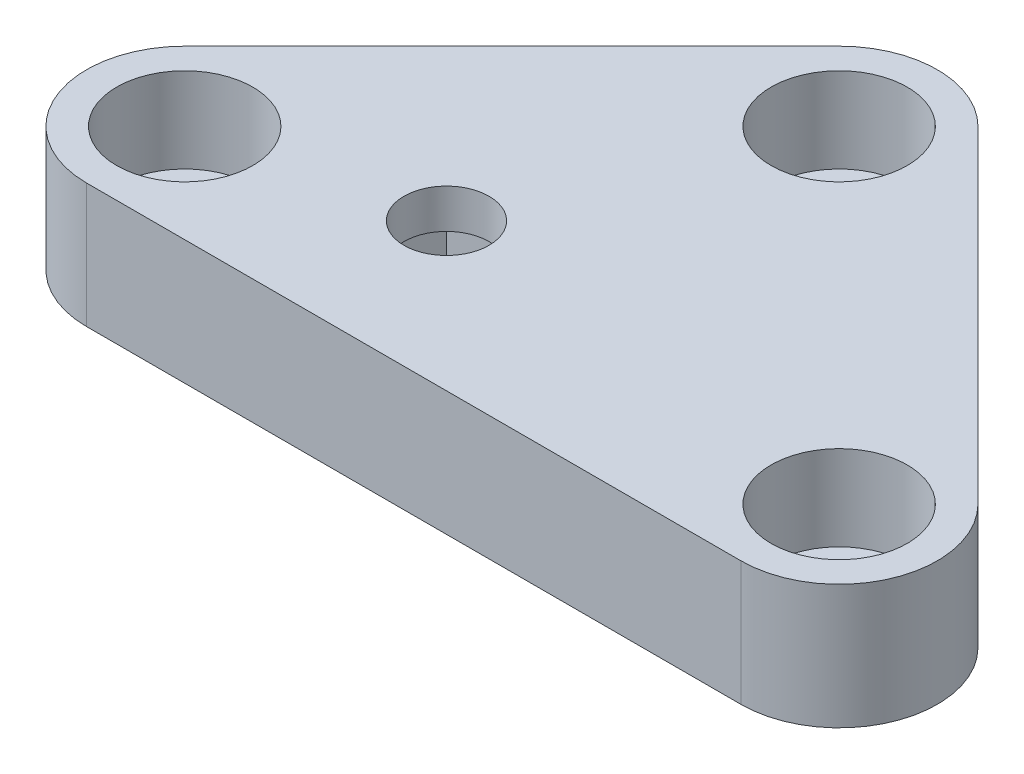
ISO-10303-21;
HEADER;
FILE_DESCRIPTION(('STEP AP214'),'2;1');
FILE_NAME('part.step','',(''),(''),'','','');
FILE_SCHEMA(('AUTOMOTIVE_DESIGN { 1 0 10303 214 1 1 1 1 }'));
ENDSEC;
DATA;
#1=APPLICATION_CONTEXT('core data for automotive mechanical design processes');
#2=APPLICATION_PROTOCOL_DEFINITION('international standard','automotive_design',2000,#1);
#3=PRODUCT_CONTEXT('',#1,'mechanical');
#4=PRODUCT('Part','Part','',(#3));
#5=PRODUCT_RELATED_PRODUCT_CATEGORY('part','',(#4));
#6=PRODUCT_DEFINITION_FORMATION('','',#4);
#7=PRODUCT_DEFINITION_CONTEXT('part definition',#1,'design');
#8=PRODUCT_DEFINITION('design','',#6,#7);
#9=PRODUCT_DEFINITION_SHAPE('','',#8);
#10=(LENGTH_UNIT() NAMED_UNIT(*) SI_UNIT(.MILLI.,.METRE.));
#11=(NAMED_UNIT(*) PLANE_ANGLE_UNIT() SI_UNIT($,.RADIAN.));
#12=(NAMED_UNIT(*) SI_UNIT($,.STERADIAN.) SOLID_ANGLE_UNIT());
#13=UNCERTAINTY_MEASURE_WITH_UNIT(LENGTH_MEASURE(1.E-05),#10,'distance_accuracy_value','');
#14=(GEOMETRIC_REPRESENTATION_CONTEXT(3) GLOBAL_UNCERTAINTY_ASSIGNED_CONTEXT((#13)) GLOBAL_UNIT_ASSIGNED_CONTEXT((#10,
#11,#12)) REPRESENTATION_CONTEXT('',''));
#15=CARTESIAN_POINT('',(0.,0.,0.));
#16=DIRECTION('',(0.,0.,1.));
#17=DIRECTION('',(1.,0.,0.));
#18=AXIS2_PLACEMENT_3D('',#15,#16,#17);
#19=CARTESIAN_POINT('',(0.,9.5,80.));
#20=DIRECTION('',(0.,-1.,0.));
#21=DIRECTION('',(0.,0.,-1.));
#22=AXIS2_PLACEMENT_3D('',#19,#20,#21);
#23=CYLINDRICAL_SURFACE('',#22,3.25);
#24=CARTESIAN_POINT('',(0.,9.5,80.));
#25=DIRECTION('',(0.,1.,0.));
#26=DIRECTION('',(0.,0.,1.));
#27=AXIS2_PLACEMENT_3D('',#24,#25,#26);
#28=CIRCLE('',#27,3.25);
#29=CARTESIAN_POINT('',(0.,9.5,83.25));
#30=VERTEX_POINT('',#29);
#31=EDGE_CURVE('E138',#30,#30,#28,.T.);
#32=ORIENTED_EDGE('',*,*,#31,.T.);
#33=EDGE_LOOP('',(#32));
#34=FACE_BOUND('',#33,.T.);
#35=CARTESIAN_POINT('',(0.,6.5,80.));
#36=DIRECTION('',(0.,-1.,0.));
#37=DIRECTION('',(0.,0.,-1.));
#38=AXIS2_PLACEMENT_3D('',#35,#36,#37);
#39=CIRCLE('',#38,3.25);
#40=CARTESIAN_POINT('',(0.,6.5,76.75));
#41=VERTEX_POINT('',#40);
#42=EDGE_CURVE('E445',#41,#41,#39,.T.);
#43=ORIENTED_EDGE('',*,*,#42,.T.);
#44=EDGE_LOOP('',(#43));
#45=FACE_BOUND('',#44,.T.);
#46=ADVANCED_FACE('F35',(#34,#45),#23,.F.);
#47=CARTESIAN_POINT('',(-16.25,9.5,83.75));
#48=DIRECTION('',(0.,-1.,0.));
#49=DIRECTION('',(0.,0.,-1.));
#50=AXIS2_PLACEMENT_3D('',#47,#48,#49);
#51=CYLINDRICAL_SURFACE('',#50,3.19999999999999);
#52=CARTESIAN_POINT('',(-16.25,0.,83.75));
#53=DIRECTION('',(0.,1.,0.));
#54=DIRECTION('',(0.,0.,1.));
#55=AXIS2_PLACEMENT_3D('',#52,#53,#54);
#56=CIRCLE('',#55,3.19999999999999);
#57=CARTESIAN_POINT('',(-16.25,0.,86.95));
#58=VERTEX_POINT('',#57);
#59=EDGE_CURVE('E187',#58,#58,#56,.T.);
#60=ORIENTED_EDGE('',*,*,#59,.F.);
#61=EDGE_LOOP('',(#60));
#62=FACE_BOUND('',#61,.T.);
#63=CARTESIAN_POINT('',(-16.25,3.,83.75));
#64=DIRECTION('',(0.,1.,0.));
#65=DIRECTION('',(0.,0.,1.));
#66=AXIS2_PLACEMENT_3D('',#63,#64,#65);
#67=CIRCLE('',#66,3.19999999999999);
#68=CARTESIAN_POINT('',(-16.25,3.,86.95));
#69=VERTEX_POINT('',#68);
#70=EDGE_CURVE('E39',#69,#69,#67,.T.);
#71=ORIENTED_EDGE('',*,*,#70,.T.);
#72=EDGE_LOOP('',(#71));
#73=FACE_BOUND('',#72,.T.);
#74=ADVANCED_FACE('F216',(#62,#73),#51,.F.);
#75=CARTESIAN_POINT('',(33.75,9.5,83.75));
#76=DIRECTION('',(0.,-1.,0.));
#77=DIRECTION('',(0.,0.,-1.));
#78=AXIS2_PLACEMENT_3D('',#75,#76,#77);
#79=CYLINDRICAL_SURFACE('',#78,3.2);
#80=CARTESIAN_POINT('',(33.75,0.,83.75));
#81=DIRECTION('',(0.,1.,0.));
#82=DIRECTION('',(0.,0.,1.));
#83=AXIS2_PLACEMENT_3D('',#80,#81,#82);
#84=CIRCLE('',#83,3.2);
#85=CARTESIAN_POINT('',(33.75,0.,86.95));
#86=VERTEX_POINT('',#85);
#87=EDGE_CURVE('E154',#86,#86,#84,.T.);
#88=ORIENTED_EDGE('',*,*,#87,.F.);
#89=EDGE_LOOP('',(#88));
#90=FACE_BOUND('',#89,.T.);
#91=CARTESIAN_POINT('',(33.75,3.,83.75));
#92=DIRECTION('',(0.,1.,0.));
#93=DIRECTION('',(0.,0.,1.));
#94=AXIS2_PLACEMENT_3D('',#91,#92,#93);
#95=CIRCLE('',#94,3.2);
#96=CARTESIAN_POINT('',(33.75,3.,86.95));
#97=VERTEX_POINT('',#96);
#98=EDGE_CURVE('E156',#97,#97,#95,.T.);
#99=ORIENTED_EDGE('',*,*,#98,.T.);
#100=EDGE_LOOP('',(#99));
#101=FACE_BOUND('',#100,.T.);
#102=ADVANCED_FACE('F222',(#90,#101),#79,.F.);
#103=CARTESIAN_POINT('',(8.75,9.5,58.75));
#104=DIRECTION('',(0.,-1.,0.));
#105=DIRECTION('',(0.,0.,-1.));
#106=AXIS2_PLACEMENT_3D('',#103,#104,#105);
#107=CYLINDRICAL_SURFACE('',#106,3.2);
#108=CARTESIAN_POINT('',(8.75,0.,58.75));
#109=DIRECTION('',(0.,1.,0.));
#110=DIRECTION('',(0.,0.,1.));
#111=AXIS2_PLACEMENT_3D('',#108,#109,#110);
#112=CIRCLE('',#111,3.2);
#113=CARTESIAN_POINT('',(8.75,0.,61.95));
#114=VERTEX_POINT('',#113);
#115=EDGE_CURVE('E190',#114,#114,#112,.T.);
#116=ORIENTED_EDGE('',*,*,#115,.F.);
#117=EDGE_LOOP('',(#116));
#118=FACE_BOUND('',#117,.T.);
#119=CARTESIAN_POINT('',(8.75,3.,58.75));
#120=DIRECTION('',(0.,1.,0.));
#121=DIRECTION('',(0.,0.,1.));
#122=AXIS2_PLACEMENT_3D('',#119,#120,#121);
#123=CIRCLE('',#122,3.2);
#124=CARTESIAN_POINT('',(8.75,3.,61.95));
#125=VERTEX_POINT('',#124);
#126=EDGE_CURVE('E152',#125,#125,#123,.T.);
#127=ORIENTED_EDGE('',*,*,#126,.T.);
#128=EDGE_LOOP('',(#127));
#129=FACE_BOUND('',#128,.T.);
#130=ADVANCED_FACE('F228',(#118,#129),#107,.F.);
#131=CARTESIAN_POINT('',(-16.25,9.5,83.75));
#132=DIRECTION('',(0.,1.,0.));
#133=DIRECTION('',(0.,0.,1.));
#134=AXIS2_PLACEMENT_3D('',#131,#132,#133);
#135=PLANE('',#134);
#136=CARTESIAN_POINT('',(33.75,9.5,83.75));
#137=DIRECTION('',(0.,1.,0.));
#138=DIRECTION('',(0.,0.,1.));
#139=AXIS2_PLACEMENT_3D('',#136,#137,#138);
#140=CIRCLE('',#139,5.2);
#141=CARTESIAN_POINT('',(33.75,9.5,88.95));
#142=VERTEX_POINT('',#141);
#143=EDGE_CURVE('E164',#142,#142,#140,.T.);
#144=ORIENTED_EDGE('',*,*,#143,.F.);
#145=EDGE_LOOP('',(#144));
#146=FACE_BOUND('',#145,.T.);
#147=CARTESIAN_POINT('',(-16.25,9.5,83.75));
#148=DIRECTION('',(0.,1.,0.));
#149=DIRECTION('',(0.,0.,1.));
#150=AXIS2_PLACEMENT_3D('',#147,#148,#149);
#151=CIRCLE('',#150,5.2);
#152=CARTESIAN_POINT('',(-16.25,9.5,88.95));
#153=VERTEX_POINT('',#152);
#154=EDGE_CURVE('E177',#153,#153,#151,.T.);
#155=ORIENTED_EDGE('',*,*,#154,.F.);
#156=EDGE_LOOP('',(#155));
#157=FACE_BOUND('',#156,.T.);
#158=CARTESIAN_POINT('',(8.75,9.5,58.75));
#159=DIRECTION('',(0.,1.,0.));
#160=DIRECTION('',(0.,0.,1.));
#161=AXIS2_PLACEMENT_3D('',#158,#159,#160);
#162=CIRCLE('',#161,5.2);
#163=CARTESIAN_POINT('',(8.75,9.5,63.95));
#164=VERTEX_POINT('',#163);
#165=EDGE_CURVE('E162',#164,#164,#162,.T.);
#166=ORIENTED_EDGE('',*,*,#165,.F.);
#167=EDGE_LOOP('',(#166));
#168=FACE_BOUND('',#167,.T.);
#169=ORIENTED_EDGE('',*,*,#31,.F.);
#170=EDGE_LOOP('',(#169));
#171=FACE_BOUND('',#170,.T.);
#172=CARTESIAN_POINT('',(-16.25,9.5,83.75));
#173=DIRECTION('',(0.,1.,0.));
#174=DIRECTION('',(0.,0.,1.));
#175=AXIS2_PLACEMENT_3D('',#172,#173,#174);
#176=CIRCLE('',#175,7.49999999999999);
#177=CARTESIAN_POINT('',(-21.5533008588991,9.5,78.4466991411009));
#178=VERTEX_POINT('',#177);
#179=CARTESIAN_POINT('',(-16.25,9.5,91.25));
#180=VERTEX_POINT('',#179);
#181=EDGE_CURVE('E146',#178,#180,#176,.T.);
#182=ORIENTED_EDGE('',*,*,#181,.T.);
#183=DIRECTION('',(1.,0.,0.));
#184=VECTOR('',#183,1.);
#185=CARTESIAN_POINT('',(-16.25,9.5,91.25));
#186=LINE('',#185,#184);
#187=CARTESIAN_POINT('',(33.75,9.5,91.25));
#188=VERTEX_POINT('',#187);
#189=EDGE_CURVE('E96',#180,#188,#186,.T.);
#190=ORIENTED_EDGE('',*,*,#189,.T.);
#191=CARTESIAN_POINT('',(33.75,9.5,83.75));
#192=DIRECTION('',(0.,1.,0.));
#193=DIRECTION('',(0.,0.,1.));
#194=AXIS2_PLACEMENT_3D('',#191,#192,#193);
#195=CIRCLE('',#194,7.49999999999999);
#196=CARTESIAN_POINT('',(39.0533008588991,9.5,78.4466991411009));
#197=VERTEX_POINT('',#196);
#198=EDGE_CURVE('E113',#188,#197,#195,.T.);
#199=ORIENTED_EDGE('',*,*,#198,.T.);
#200=DIRECTION('',(-0.707106781186547,0.,-0.707106781186548));
#201=VECTOR('',#200,1.);
#202=CARTESIAN_POINT('',(14.0533008588991,9.5,53.4466991411009));
#203=LINE('',#202,#201);
#204=CARTESIAN_POINT('',(14.0533008588991,9.5,53.4466991411009));
#205=VERTEX_POINT('',#204);
#206=EDGE_CURVE('E106',#197,#205,#203,.T.);
#207=ORIENTED_EDGE('',*,*,#206,.T.);
#208=CARTESIAN_POINT('',(8.75,9.5,58.75));
#209=DIRECTION('',(0.,1.,0.));
#210=DIRECTION('',(0.,0.,1.));
#211=AXIS2_PLACEMENT_3D('',#208,#209,#210);
#212=CIRCLE('',#211,7.49999999999999);
#213=CARTESIAN_POINT('',(3.4466991411009,9.5,53.4466991411009));
#214=VERTEX_POINT('',#213);
#215=EDGE_CURVE('E110',#205,#214,#212,.T.);
#216=ORIENTED_EDGE('',*,*,#215,.T.);
#217=DIRECTION('',(-0.707106781186547,0.,0.707106781186548));
#218=VECTOR('',#217,1.);
#219=CARTESIAN_POINT('',(3.4466991411009,9.5,53.4466991411009));
#220=LINE('',#219,#218);
#221=EDGE_CURVE('E61',#214,#178,#220,.T.);
#222=ORIENTED_EDGE('',*,*,#221,.T.);
#223=EDGE_LOOP('',(#182,#190,#199,#207,#216,#222));
#224=FACE_BOUND('',#223,.T.);
#225=ADVANCED_FACE('F108',(#146,#157,#168,#171,#224),#135,.T.);
#226=CARTESIAN_POINT('',(-16.25,0.,83.75));
#227=DIRECTION('',(0.,1.,0.));
#228=DIRECTION('',(0.,0.,1.));
#229=AXIS2_PLACEMENT_3D('',#226,#227,#228);
#230=PLANE('',#229);
#231=DIRECTION('',(1.,0.,0.));
#232=VECTOR('',#231,1.);
#233=CARTESIAN_POINT('',(-5.2,0.,74.8));
#234=LINE('',#233,#232);
#235=CARTESIAN_POINT('',(-5.2,0.,74.8));
#236=VERTEX_POINT('',#235);
#237=CARTESIAN_POINT('',(5.2,0.,74.8));
#238=VERTEX_POINT('',#237);
#239=EDGE_CURVE('E471',#236,#238,#234,.T.);
#240=ORIENTED_EDGE('',*,*,#239,.F.);
#241=DIRECTION('',(0.,0.,-1.));
#242=VECTOR('',#241,1.);
#243=CARTESIAN_POINT('',(-5.2,0.,85.2));
#244=LINE('',#243,#242);
#245=CARTESIAN_POINT('',(-5.2,0.,85.2));
#246=VERTEX_POINT('',#245);
#247=EDGE_CURVE('E52',#246,#236,#244,.T.);
#248=ORIENTED_EDGE('',*,*,#247,.F.);
#249=DIRECTION('',(-1.,0.,0.));
#250=VECTOR('',#249,1.);
#251=CARTESIAN_POINT('',(-5.2,0.,85.2));
#252=LINE('',#251,#250);
#253=CARTESIAN_POINT('',(5.2,0.,85.2));
#254=VERTEX_POINT('',#253);
#255=EDGE_CURVE('E459',#254,#246,#252,.T.);
#256=ORIENTED_EDGE('',*,*,#255,.F.);
#257=DIRECTION('',(0.,0.,1.));
#258=VECTOR('',#257,1.);
#259=CARTESIAN_POINT('',(5.2,0.,85.2));
#260=LINE('',#259,#258);
#261=EDGE_CURVE('E464',#238,#254,#260,.T.);
#262=ORIENTED_EDGE('',*,*,#261,.F.);
#263=EDGE_LOOP('',(#240,#248,#256,#262));
#264=FACE_BOUND('',#263,.T.);
#265=CARTESIAN_POINT('',(-16.25,0.,83.75));
#266=DIRECTION('',(0.,1.,0.));
#267=DIRECTION('',(0.,0.,1.));
#268=AXIS2_PLACEMENT_3D('',#265,#266,#267);
#269=CIRCLE('',#268,7.49999999999999);
#270=CARTESIAN_POINT('',(-21.5533008588991,0.,78.4466991411009));
#271=VERTEX_POINT('',#270);
#272=CARTESIAN_POINT('',(-16.25,0.,91.25));
#273=VERTEX_POINT('',#272);
#274=EDGE_CURVE('E134',#271,#273,#269,.T.);
#275=ORIENTED_EDGE('',*,*,#274,.F.);
#276=DIRECTION('',(-0.707106781186547,0.,0.707106781186548));
#277=VECTOR('',#276,1.);
#278=CARTESIAN_POINT('',(3.4466991411009,0.,53.4466991411009));
#279=LINE('',#278,#277);
#280=CARTESIAN_POINT('',(3.4466991411009,0.,53.4466991411009));
#281=VERTEX_POINT('',#280);
#282=EDGE_CURVE('E88',#281,#271,#279,.T.);
#283=ORIENTED_EDGE('',*,*,#282,.F.);
#284=CARTESIAN_POINT('',(8.75,0.,58.75));
#285=DIRECTION('',(0.,1.,0.));
#286=DIRECTION('',(0.,0.,1.));
#287=AXIS2_PLACEMENT_3D('',#284,#285,#286);
#288=CIRCLE('',#287,7.49999999999999);
#289=CARTESIAN_POINT('',(14.0533008588991,0.,53.4466991411009));
#290=VERTEX_POINT('',#289);
#291=EDGE_CURVE('E143',#290,#281,#288,.T.);
#292=ORIENTED_EDGE('',*,*,#291,.F.);
#293=DIRECTION('',(-0.707106781186547,0.,-0.707106781186548));
#294=VECTOR('',#293,1.);
#295=CARTESIAN_POINT('',(14.0533008588991,0.,53.4466991411009));
#296=LINE('',#295,#294);
#297=CARTESIAN_POINT('',(39.0533008588991,0.,78.4466991411009));
#298=VERTEX_POINT('',#297);
#299=EDGE_CURVE('E122',#298,#290,#296,.T.);
#300=ORIENTED_EDGE('',*,*,#299,.F.);
#301=CARTESIAN_POINT('',(33.75,0.,83.75));
#302=DIRECTION('',(0.,1.,0.));
#303=DIRECTION('',(0.,0.,1.));
#304=AXIS2_PLACEMENT_3D('',#301,#302,#303);
#305=CIRCLE('',#304,7.49999999999999);
#306=CARTESIAN_POINT('',(33.75,0.,91.25));
#307=VERTEX_POINT('',#306);
#308=EDGE_CURVE('E140',#307,#298,#305,.T.);
#309=ORIENTED_EDGE('',*,*,#308,.F.);
#310=DIRECTION('',(1.,0.,0.));
#311=VECTOR('',#310,1.);
#312=CARTESIAN_POINT('',(-16.25,0.,91.25));
#313=LINE('',#312,#311);
#314=EDGE_CURVE('E137',#273,#307,#313,.T.);
#315=ORIENTED_EDGE('',*,*,#314,.F.);
#316=EDGE_LOOP('',(#275,#283,#292,#300,#309,#315));
#317=FACE_BOUND('',#316,.T.);
#318=ORIENTED_EDGE('',*,*,#115,.T.);
#319=EDGE_LOOP('',(#318));
#320=FACE_BOUND('',#319,.T.);
#321=ORIENTED_EDGE('',*,*,#59,.T.);
#322=EDGE_LOOP('',(#321));
#323=FACE_BOUND('',#322,.T.);
#324=ORIENTED_EDGE('',*,*,#87,.T.);
#325=EDGE_LOOP('',(#324));
#326=FACE_BOUND('',#325,.T.);
#327=ADVANCED_FACE('F204',(#264,#317,#320,#323,#326),#230,.F.);
#328=CARTESIAN_POINT('',(-16.25,9.5,83.75));
#329=DIRECTION('',(0.,-1.,0.));
#330=DIRECTION('',(0.,0.,-1.));
#331=AXIS2_PLACEMENT_3D('',#328,#329,#330);
#332=CYLINDRICAL_SURFACE('',#331,7.49999999999999);
#333=ORIENTED_EDGE('',*,*,#274,.T.);
#334=DIRECTION('',(0.,-1.,0.));
#335=VECTOR('',#334,1.);
#336=CARTESIAN_POINT('',(-16.25,9.5,91.25));
#337=LINE('',#336,#335);
#338=EDGE_CURVE('E11',#180,#273,#337,.T.);
#339=ORIENTED_EDGE('',*,*,#338,.F.);
#340=ORIENTED_EDGE('',*,*,#181,.F.);
#341=DIRECTION('',(0.,-1.,0.));
#342=VECTOR('',#341,1.);
#343=CARTESIAN_POINT('',(-21.5533008588991,9.5,78.4466991411009));
#344=LINE('',#343,#342);
#345=EDGE_CURVE('E130',#178,#271,#344,.T.);
#346=ORIENTED_EDGE('',*,*,#345,.T.);
#347=EDGE_LOOP('',(#333,#339,#340,#346));
#348=FACE_BOUND('',#347,.T.);
#349=ADVANCED_FACE('F37',(#348),#332,.T.);
#350=CARTESIAN_POINT('',(-16.25,9.5,91.25));
#351=DIRECTION('',(0.,0.,-1.));
#352=DIRECTION('',(-1.,0.,0.));
#353=AXIS2_PLACEMENT_3D('',#350,#351,#352);
#354=PLANE('',#353);
#355=ORIENTED_EDGE('',*,*,#314,.T.);
#356=DIRECTION('',(0.,-1.,0.));
#357=VECTOR('',#356,1.);
#358=CARTESIAN_POINT('',(33.75,9.5,91.25));
#359=LINE('',#358,#357);
#360=EDGE_CURVE('E44',#188,#307,#359,.T.);
#361=ORIENTED_EDGE('',*,*,#360,.F.);
#362=ORIENTED_EDGE('',*,*,#189,.F.);
#363=ORIENTED_EDGE('',*,*,#338,.T.);
#364=EDGE_LOOP('',(#355,#361,#362,#363));
#365=FACE_BOUND('',#364,.T.);
#366=ADVANCED_FACE('F198',(#365),#354,.F.);
#367=CARTESIAN_POINT('',(33.75,9.5,83.75));
#368=DIRECTION('',(0.,-1.,0.));
#369=DIRECTION('',(0.,0.,-1.));
#370=AXIS2_PLACEMENT_3D('',#367,#368,#369);
#371=CYLINDRICAL_SURFACE('',#370,7.49999999999999);
#372=ORIENTED_EDGE('',*,*,#308,.T.);
#373=DIRECTION('',(0.,-1.,0.));
#374=VECTOR('',#373,1.);
#375=CARTESIAN_POINT('',(39.0533008588991,9.5,78.4466991411009));
#376=LINE('',#375,#374);
#377=EDGE_CURVE('E125',#197,#298,#376,.T.);
#378=ORIENTED_EDGE('',*,*,#377,.F.);
#379=ORIENTED_EDGE('',*,*,#198,.F.);
#380=ORIENTED_EDGE('',*,*,#360,.T.);
#381=EDGE_LOOP('',(#372,#378,#379,#380));
#382=FACE_BOUND('',#381,.T.);
#383=ADVANCED_FACE('F201',(#382),#371,.T.);
#384=CARTESIAN_POINT('',(14.0533008588991,9.5,53.4466991411009));
#385=DIRECTION('',(-0.707106781186548,0.,0.707106781186547));
#386=DIRECTION('',(0.707106781186547,0.,0.707106781186548));
#387=AXIS2_PLACEMENT_3D('',#384,#385,#386);
#388=PLANE('',#387);
#389=ORIENTED_EDGE('',*,*,#299,.T.);
#390=DIRECTION('',(0.,-1.,0.));
#391=VECTOR('',#390,1.);
#392=CARTESIAN_POINT('',(14.0533008588991,9.5,53.4466991411009));
#393=LINE('',#392,#391);
#394=EDGE_CURVE('E119',#205,#290,#393,.T.);
#395=ORIENTED_EDGE('',*,*,#394,.F.);
#396=ORIENTED_EDGE('',*,*,#206,.F.);
#397=ORIENTED_EDGE('',*,*,#377,.T.);
#398=EDGE_LOOP('',(#389,#395,#396,#397));
#399=FACE_BOUND('',#398,.T.);
#400=ADVANCED_FACE('F120',(#399),#388,.F.);
#401=CARTESIAN_POINT('',(8.75,9.5,58.75));
#402=DIRECTION('',(0.,-1.,0.));
#403=DIRECTION('',(0.,0.,-1.));
#404=AXIS2_PLACEMENT_3D('',#401,#402,#403);
#405=CYLINDRICAL_SURFACE('',#404,7.49999999999999);
#406=ORIENTED_EDGE('',*,*,#291,.T.);
#407=DIRECTION('',(0.,-1.,0.));
#408=VECTOR('',#407,1.);
#409=CARTESIAN_POINT('',(3.4466991411009,9.5,53.4466991411009));
#410=LINE('',#409,#408);
#411=EDGE_CURVE('E126',#214,#281,#410,.T.);
#412=ORIENTED_EDGE('',*,*,#411,.F.);
#413=ORIENTED_EDGE('',*,*,#215,.F.);
#414=ORIENTED_EDGE('',*,*,#394,.T.);
#415=EDGE_LOOP('',(#406,#412,#413,#414));
#416=FACE_BOUND('',#415,.T.);
#417=ADVANCED_FACE('F128',(#416),#405,.T.);
#418=CARTESIAN_POINT('',(3.4466991411009,9.5,53.4466991411009));
#419=DIRECTION('',(0.707106781186548,0.,0.707106781186548));
#420=DIRECTION('',(0.707106781186548,0.,-0.707106781186548));
#421=AXIS2_PLACEMENT_3D('',#418,#419,#420);
#422=PLANE('',#421);
#423=ORIENTED_EDGE('',*,*,#282,.T.);
#424=ORIENTED_EDGE('',*,*,#345,.F.);
#425=ORIENTED_EDGE('',*,*,#221,.F.);
#426=ORIENTED_EDGE('',*,*,#411,.T.);
#427=EDGE_LOOP('',(#423,#424,#425,#426));
#428=FACE_BOUND('',#427,.T.);
#429=ADVANCED_FACE('F206',(#428),#422,.F.);
#430=CARTESIAN_POINT('',(8.75,3.,58.75));
#431=DIRECTION('',(0.,1.,0.));
#432=DIRECTION('',(0.,0.,1.));
#433=AXIS2_PLACEMENT_3D('',#430,#431,#432);
#434=CYLINDRICAL_SURFACE('',#433,5.2);
#435=CARTESIAN_POINT('',(8.75,3.,58.75));
#436=DIRECTION('',(0.,1.,0.));
#437=DIRECTION('',(0.,0.,1.));
#438=AXIS2_PLACEMENT_3D('',#435,#436,#437);
#439=CIRCLE('',#438,5.2);
#440=CARTESIAN_POINT('',(8.75,3.,63.95));
#441=VERTEX_POINT('',#440);
#442=EDGE_CURVE('E155',#441,#441,#439,.T.);
#443=ORIENTED_EDGE('',*,*,#442,.F.);
#444=EDGE_LOOP('',(#443));
#445=FACE_BOUND('',#444,.T.);
#446=ORIENTED_EDGE('',*,*,#165,.T.);
#447=EDGE_LOOP('',(#446));
#448=FACE_BOUND('',#447,.T.);
#449=ADVANCED_FACE('F234',(#445,#448),#434,.F.);
#450=CARTESIAN_POINT('',(8.75,3.,58.75));
#451=DIRECTION('',(0.,1.,0.));
#452=DIRECTION('',(0.,0.,1.));
#453=AXIS2_PLACEMENT_3D('',#450,#451,#452);
#454=PLANE('',#453);
#455=ORIENTED_EDGE('',*,*,#126,.F.);
#456=EDGE_LOOP('',(#455));
#457=FACE_BOUND('',#456,.T.);
#458=ORIENTED_EDGE('',*,*,#442,.T.);
#459=EDGE_LOOP('',(#458));
#460=FACE_BOUND('',#459,.T.);
#461=ADVANCED_FACE('F263',(#457,#460),#454,.T.);
#462=CARTESIAN_POINT('',(33.75,3.,83.75));
#463=DIRECTION('',(0.,1.,0.));
#464=DIRECTION('',(0.,0.,1.));
#465=AXIS2_PLACEMENT_3D('',#462,#463,#464);
#466=CYLINDRICAL_SURFACE('',#465,5.2);
#467=CARTESIAN_POINT('',(33.75,3.,83.75));
#468=DIRECTION('',(0.,1.,0.));
#469=DIRECTION('',(0.,0.,1.));
#470=AXIS2_PLACEMENT_3D('',#467,#468,#469);
#471=CIRCLE('',#470,5.2);
#472=CARTESIAN_POINT('',(33.75,3.,88.95));
#473=VERTEX_POINT('',#472);
#474=EDGE_CURVE('E158',#473,#473,#471,.T.);
#475=ORIENTED_EDGE('',*,*,#474,.F.);
#476=EDGE_LOOP('',(#475));
#477=FACE_BOUND('',#476,.T.);
#478=ORIENTED_EDGE('',*,*,#143,.T.);
#479=EDGE_LOOP('',(#478));
#480=FACE_BOUND('',#479,.T.);
#481=ADVANCED_FACE('F272',(#477,#480),#466,.F.);
#482=CARTESIAN_POINT('',(33.75,3.,83.75));
#483=DIRECTION('',(0.,1.,0.));
#484=DIRECTION('',(0.,0.,1.));
#485=AXIS2_PLACEMENT_3D('',#482,#483,#484);
#486=PLANE('',#485);
#487=ORIENTED_EDGE('',*,*,#98,.F.);
#488=EDGE_LOOP('',(#487));
#489=FACE_BOUND('',#488,.T.);
#490=ORIENTED_EDGE('',*,*,#474,.T.);
#491=EDGE_LOOP('',(#490));
#492=FACE_BOUND('',#491,.T.);
#493=ADVANCED_FACE('F280',(#489,#492),#486,.T.);
#494=CARTESIAN_POINT('',(-16.25,3.,83.75));
#495=DIRECTION('',(0.,1.,0.));
#496=DIRECTION('',(0.,0.,1.));
#497=AXIS2_PLACEMENT_3D('',#494,#495,#496);
#498=CYLINDRICAL_SURFACE('',#497,5.2);
#499=CARTESIAN_POINT('',(-16.25,3.,83.75));
#500=DIRECTION('',(0.,1.,0.));
#501=DIRECTION('',(0.,0.,1.));
#502=AXIS2_PLACEMENT_3D('',#499,#500,#501);
#503=CIRCLE('',#502,5.2);
#504=CARTESIAN_POINT('',(-16.25,3.,88.95));
#505=VERTEX_POINT('',#504);
#506=EDGE_CURVE('E169',#505,#505,#503,.T.);
#507=ORIENTED_EDGE('',*,*,#506,.F.);
#508=EDGE_LOOP('',(#507));
#509=FACE_BOUND('',#508,.T.);
#510=ORIENTED_EDGE('',*,*,#154,.T.);
#511=EDGE_LOOP('',(#510));
#512=FACE_BOUND('',#511,.T.);
#513=ADVANCED_FACE('F288',(#509,#512),#498,.F.);
#514=CARTESIAN_POINT('',(-16.25,3.,83.75));
#515=DIRECTION('',(0.,1.,0.));
#516=DIRECTION('',(0.,0.,1.));
#517=AXIS2_PLACEMENT_3D('',#514,#515,#516);
#518=PLANE('',#517);
#519=ORIENTED_EDGE('',*,*,#70,.F.);
#520=EDGE_LOOP('',(#519));
#521=FACE_BOUND('',#520,.T.);
#522=ORIENTED_EDGE('',*,*,#506,.T.);
#523=EDGE_LOOP('',(#522));
#524=FACE_BOUND('',#523,.T.);
#525=ADVANCED_FACE('F296',(#521,#524),#518,.T.);
#526=CARTESIAN_POINT('',(-5.2,6.5,85.2));
#527=DIRECTION('',(-1.,0.,0.));
#528=DIRECTION('',(0.,0.,1.));
#529=AXIS2_PLACEMENT_3D('',#526,#527,#528);
#530=PLANE('',#529);
#531=ORIENTED_EDGE('',*,*,#247,.T.);
#532=DIRECTION('',(0.,-1.,0.));
#533=VECTOR('',#532,1.);
#534=CARTESIAN_POINT('',(-5.2,6.5,74.8));
#535=LINE('',#534,#533);
#536=CARTESIAN_POINT('',(-5.2,6.5,74.8));
#537=VERTEX_POINT('',#536);
#538=EDGE_CURVE('E172',#537,#236,#535,.T.);
#539=ORIENTED_EDGE('',*,*,#538,.F.);
#540=DIRECTION('',(0.,0.,-1.));
#541=VECTOR('',#540,1.);
#542=CARTESIAN_POINT('',(-5.2,6.5,85.2));
#543=LINE('',#542,#541);
#544=CARTESIAN_POINT('',(-5.2,6.5,85.2));
#545=VERTEX_POINT('',#544);
#546=EDGE_CURVE('E451',#545,#537,#543,.T.);
#547=ORIENTED_EDGE('',*,*,#546,.F.);
#548=DIRECTION('',(0.,-1.,0.));
#549=VECTOR('',#548,1.);
#550=CARTESIAN_POINT('',(-5.2,6.5,85.2));
#551=LINE('',#550,#549);
#552=EDGE_CURVE('E180',#545,#246,#551,.T.);
#553=ORIENTED_EDGE('',*,*,#552,.T.);
#554=EDGE_LOOP('',(#531,#539,#547,#553));
#555=FACE_BOUND('',#554,.T.);
#556=ADVANCED_FACE('F304',(#555),#530,.F.);
#557=CARTESIAN_POINT('',(-5.2,6.5,85.2));
#558=DIRECTION('',(0.,0.,1.));
#559=DIRECTION('',(1.,0.,0.));
#560=AXIS2_PLACEMENT_3D('',#557,#558,#559);
#561=PLANE('',#560);
#562=ORIENTED_EDGE('',*,*,#255,.T.);
#563=ORIENTED_EDGE('',*,*,#552,.F.);
#564=DIRECTION('',(-1.,0.,0.));
#565=VECTOR('',#564,1.);
#566=CARTESIAN_POINT('',(-5.2,6.5,85.2));
#567=LINE('',#566,#565);
#568=CARTESIAN_POINT('',(5.2,6.5,85.2));
#569=VERTEX_POINT('',#568);
#570=EDGE_CURVE('E457',#569,#545,#567,.T.);
#571=ORIENTED_EDGE('',*,*,#570,.F.);
#572=DIRECTION('',(0.,-1.,0.));
#573=VECTOR('',#572,1.);
#574=CARTESIAN_POINT('',(5.2,6.5,85.2));
#575=LINE('',#574,#573);
#576=EDGE_CURVE('E477',#569,#254,#575,.T.);
#577=ORIENTED_EDGE('',*,*,#576,.T.);
#578=EDGE_LOOP('',(#562,#563,#571,#577));
#579=FACE_BOUND('',#578,.T.);
#580=ADVANCED_FACE('F312',(#579),#561,.F.);
#581=CARTESIAN_POINT('',(5.2,6.5,85.2));
#582=DIRECTION('',(1.,0.,0.));
#583=DIRECTION('',(0.,0.,-1.));
#584=AXIS2_PLACEMENT_3D('',#581,#582,#583);
#585=PLANE('',#584);
#586=ORIENTED_EDGE('',*,*,#261,.T.);
#587=ORIENTED_EDGE('',*,*,#576,.F.);
#588=DIRECTION('',(0.,0.,1.));
#589=VECTOR('',#588,1.);
#590=CARTESIAN_POINT('',(5.2,6.5,85.2));
#591=LINE('',#590,#589);
#592=CARTESIAN_POINT('',(5.2,6.5,74.8));
#593=VERTEX_POINT('',#592);
#594=EDGE_CURVE('E461',#593,#569,#591,.T.);
#595=ORIENTED_EDGE('',*,*,#594,.F.);
#596=DIRECTION('',(0.,-1.,0.));
#597=VECTOR('',#596,1.);
#598=CARTESIAN_POINT('',(5.2,6.5,74.8));
#599=LINE('',#598,#597);
#600=EDGE_CURVE('E479',#593,#238,#599,.T.);
#601=ORIENTED_EDGE('',*,*,#600,.T.);
#602=EDGE_LOOP('',(#586,#587,#595,#601));
#603=FACE_BOUND('',#602,.T.);
#604=ADVANCED_FACE('F320',(#603),#585,.F.);
#605=CARTESIAN_POINT('',(-5.2,6.5,74.8));
#606=DIRECTION('',(0.,0.,-1.));
#607=DIRECTION('',(-1.,0.,0.));
#608=AXIS2_PLACEMENT_3D('',#605,#606,#607);
#609=PLANE('',#608);
#610=ORIENTED_EDGE('',*,*,#239,.T.);
#611=ORIENTED_EDGE('',*,*,#600,.F.);
#612=DIRECTION('',(1.,0.,0.));
#613=VECTOR('',#612,1.);
#614=CARTESIAN_POINT('',(-5.2,6.5,74.8));
#615=LINE('',#614,#613);
#616=EDGE_CURVE('E455',#537,#593,#615,.T.);
#617=ORIENTED_EDGE('',*,*,#616,.F.);
#618=ORIENTED_EDGE('',*,*,#538,.T.);
#619=EDGE_LOOP('',(#610,#611,#617,#618));
#620=FACE_BOUND('',#619,.T.);
#621=ADVANCED_FACE('F328',(#620),#609,.F.);
#622=CARTESIAN_POINT('',(0.,6.5,0.));
#623=DIRECTION('',(0.,-1.,0.));
#624=DIRECTION('',(0.,0.,-1.));
#625=AXIS2_PLACEMENT_3D('',#622,#623,#624);
#626=PLANE('',#625);
#627=ORIENTED_EDGE('',*,*,#42,.F.);
#628=EDGE_LOOP('',(#627));
#629=FACE_BOUND('',#628,.T.);
#630=ORIENTED_EDGE('',*,*,#546,.T.);
#631=ORIENTED_EDGE('',*,*,#616,.T.);
#632=ORIENTED_EDGE('',*,*,#594,.T.);
#633=ORIENTED_EDGE('',*,*,#570,.T.);
#634=EDGE_LOOP('',(#630,#631,#632,#633));
#635=FACE_BOUND('',#634,.T.);
#636=ADVANCED_FACE('F336',(#629,#635),#626,.T.);
#637=CLOSED_SHELL('',(#46,#74,#102,#130,#225,#327,#349,#366,#383,#400,#417,#429,#449,#461,#481,
#493,#513,#525,#556,#580,#604,#621,#636));
#638=MANIFOLD_SOLID_BREP('B2',#637);
#639=ADVANCED_BREP_SHAPE_REPRESENTATION('',(#18,#638),#14);
#640=SHAPE_DEFINITION_REPRESENTATION(#9,#639);
ENDSEC;
END-ISO-10303-21;
